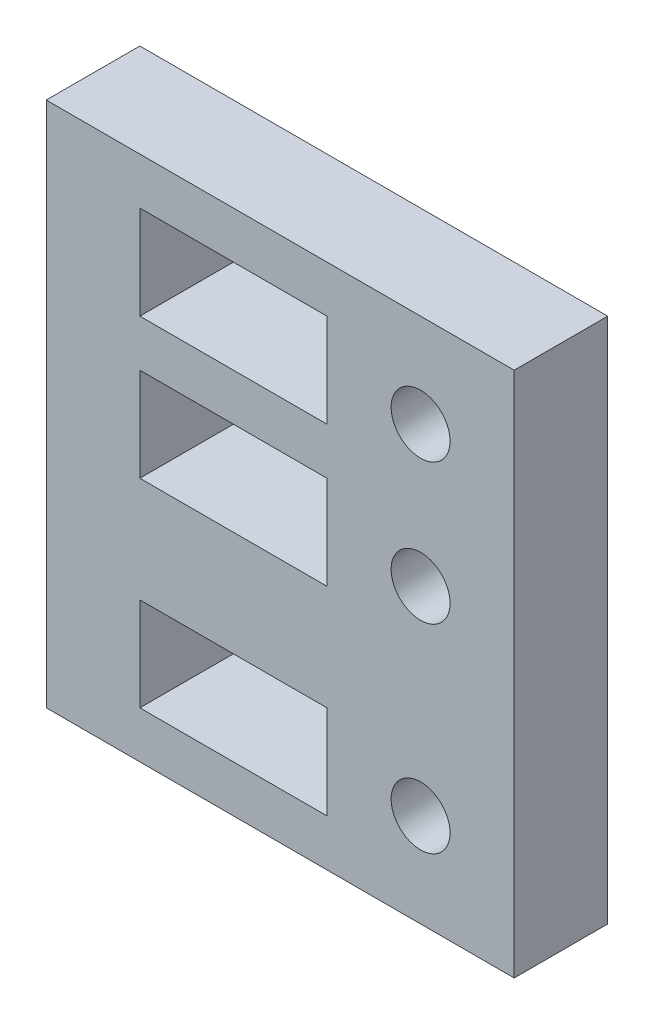
ISO-10303-21;
HEADER;
FILE_DESCRIPTION(('STEP AP214'),'2;1');
FILE_NAME('part.step','',(''),(''),'','','');
FILE_SCHEMA(('AUTOMOTIVE_DESIGN { 1 0 10303 214 1 1 1 1 }'));
ENDSEC;
DATA;
#1=APPLICATION_CONTEXT('core data for automotive mechanical design processes');
#2=APPLICATION_PROTOCOL_DEFINITION('international standard','automotive_design',2000,#1);
#3=PRODUCT_CONTEXT('',#1,'mechanical');
#4=PRODUCT('Part','Part','',(#3));
#5=PRODUCT_RELATED_PRODUCT_CATEGORY('part','',(#4));
#6=PRODUCT_DEFINITION_FORMATION('','',#4);
#7=PRODUCT_DEFINITION_CONTEXT('part definition',#1,'design');
#8=PRODUCT_DEFINITION('design','',#6,#7);
#9=PRODUCT_DEFINITION_SHAPE('','',#8);
#10=(LENGTH_UNIT() NAMED_UNIT(*) SI_UNIT(.MILLI.,.METRE.));
#11=(NAMED_UNIT(*) PLANE_ANGLE_UNIT() SI_UNIT($,.RADIAN.));
#12=(NAMED_UNIT(*) SI_UNIT($,.STERADIAN.) SOLID_ANGLE_UNIT());
#13=UNCERTAINTY_MEASURE_WITH_UNIT(LENGTH_MEASURE(1.E-05),#10,'distance_accuracy_value','');
#14=(GEOMETRIC_REPRESENTATION_CONTEXT(3) GLOBAL_UNCERTAINTY_ASSIGNED_CONTEXT((#13)) GLOBAL_UNIT_ASSIGNED_CONTEXT((#10,
#11,#12)) REPRESENTATION_CONTEXT('',''));
#15=CARTESIAN_POINT('',(0.,0.,0.));
#16=DIRECTION('',(0.,0.,1.));
#17=DIRECTION('',(1.,0.,0.));
#18=AXIS2_PLACEMENT_3D('',#15,#16,#17);
#19=CARTESIAN_POINT('',(0.,0.,6.35));
#20=DIRECTION('',(0.,0.,-1.));
#21=DIRECTION('',(-1.,0.,0.));
#22=AXIS2_PLACEMENT_3D('',#19,#20,#21);
#23=PLANE('',#22);
#24=CARTESIAN_POINT('',(25.4,6.35,6.35));
#25=DIRECTION('',(0.,0.,1.));
#26=DIRECTION('',(1.,0.,0.));
#27=AXIS2_PLACEMENT_3D('',#24,#25,#26);
#28=CIRCLE('',#27,2.);
#29=CARTESIAN_POINT('',(27.4,6.35,6.35));
#30=VERTEX_POINT('',#29);
#31=EDGE_CURVE('E185',#30,#30,#28,.T.);
#32=ORIENTED_EDGE('',*,*,#31,.F.);
#33=EDGE_LOOP('',(#32));
#34=FACE_BOUND('',#33,.T.);
#35=CARTESIAN_POINT('',(25.4,19.84375,6.35));
#36=DIRECTION('',(0.,0.,1.));
#37=DIRECTION('',(1.,0.,0.));
#38=AXIS2_PLACEMENT_3D('',#35,#36,#37);
#39=CIRCLE('',#38,2.);
#40=CARTESIAN_POINT('',(27.4,19.84375,6.35));
#41=VERTEX_POINT('',#40);
#42=EDGE_CURVE('E191',#41,#41,#39,.T.);
#43=ORIENTED_EDGE('',*,*,#42,.F.);
#44=EDGE_LOOP('',(#43));
#45=FACE_BOUND('',#44,.T.);
#46=DIRECTION('',(0.,-1.,0.));
#47=VECTOR('',#46,1.);
#48=CARTESIAN_POINT('',(6.35,9.525,6.35));
#49=LINE('',#48,#47);
#50=CARTESIAN_POINT('',(6.35,9.525,6.35));
#51=VERTEX_POINT('',#50);
#52=CARTESIAN_POINT('',(6.35,3.175,6.35));
#53=VERTEX_POINT('',#52);
#54=EDGE_CURVE('E197',#51,#53,#49,.T.);
#55=ORIENTED_EDGE('',*,*,#54,.F.);
#56=DIRECTION('',(-1.,0.,0.));
#57=VECTOR('',#56,1.);
#58=CARTESIAN_POINT('',(6.35,9.525,6.35));
#59=LINE('',#58,#57);
#60=CARTESIAN_POINT('',(19.05,9.525,6.35));
#61=VERTEX_POINT('',#60);
#62=EDGE_CURVE('E205',#61,#51,#59,.T.);
#63=ORIENTED_EDGE('',*,*,#62,.F.);
#64=DIRECTION('',(0.,1.,0.));
#65=VECTOR('',#64,1.);
#66=CARTESIAN_POINT('',(19.05,9.525,6.35));
#67=LINE('',#66,#65);
#68=CARTESIAN_POINT('',(19.05,3.175,6.35));
#69=VERTEX_POINT('',#68);
#70=EDGE_CURVE('E202',#69,#61,#67,.T.);
#71=ORIENTED_EDGE('',*,*,#70,.F.);
#72=DIRECTION('',(1.,0.,0.));
#73=VECTOR('',#72,1.);
#74=CARTESIAN_POINT('',(6.35,3.175,6.35));
#75=LINE('',#74,#73);
#76=EDGE_CURVE('E199',#53,#69,#75,.T.);
#77=ORIENTED_EDGE('',*,*,#76,.F.);
#78=EDGE_LOOP('',(#55,#63,#71,#77));
#79=FACE_BOUND('',#78,.T.);
#80=DIRECTION('',(0.,-1.,0.));
#81=VECTOR('',#80,1.);
#82=CARTESIAN_POINT('',(0.,0.,6.35));
#83=LINE('',#82,#81);
#84=CARTESIAN_POINT('',(0.,35.71875,6.35));
#85=VERTEX_POINT('',#84);
#86=CARTESIAN_POINT('',(0.,0.,6.35));
#87=VERTEX_POINT('',#86);
#88=EDGE_CURVE('E259',#85,#87,#83,.T.);
#89=ORIENTED_EDGE('',*,*,#88,.T.);
#90=DIRECTION('',(1.,0.,0.));
#91=VECTOR('',#90,1.);
#92=CARTESIAN_POINT('',(0.,0.,6.35));
#93=LINE('',#92,#91);
#94=CARTESIAN_POINT('',(31.75,0.,6.35));
#95=VERTEX_POINT('',#94);
#96=EDGE_CURVE('E262',#87,#95,#93,.T.);
#97=ORIENTED_EDGE('',*,*,#96,.T.);
#98=DIRECTION('',(0.,1.,0.));
#99=VECTOR('',#98,1.);
#100=CARTESIAN_POINT('',(31.75,0.,6.35));
#101=LINE('',#100,#99);
#102=CARTESIAN_POINT('',(31.75,35.71875,6.35));
#103=VERTEX_POINT('',#102);
#104=EDGE_CURVE('E265',#95,#103,#101,.T.);
#105=ORIENTED_EDGE('',*,*,#104,.T.);
#106=DIRECTION('',(-1.,0.,0.));
#107=VECTOR('',#106,1.);
#108=CARTESIAN_POINT('',(0.,35.71875,6.35));
#109=LINE('',#108,#107);
#110=EDGE_CURVE('E267',#103,#85,#109,.T.);
#111=ORIENTED_EDGE('',*,*,#110,.T.);
#112=EDGE_LOOP('',(#89,#97,#105,#111));
#113=FACE_BOUND('',#112,.T.);
#114=DIRECTION('',(0.,-1.,0.));
#115=VECTOR('',#114,1.);
#116=CARTESIAN_POINT('',(6.35,23.01875,6.35));
#117=LINE('',#116,#115);
#118=CARTESIAN_POINT('',(6.35,23.01875,6.35));
#119=VERTEX_POINT('',#118);
#120=CARTESIAN_POINT('',(6.35,16.66875,6.35));
#121=VERTEX_POINT('',#120);
#122=EDGE_CURVE('E228',#119,#121,#117,.T.);
#123=ORIENTED_EDGE('',*,*,#122,.F.);
#124=DIRECTION('',(-1.,0.,0.));
#125=VECTOR('',#124,1.);
#126=CARTESIAN_POINT('',(6.35,23.01875,6.35));
#127=LINE('',#126,#125);
#128=CARTESIAN_POINT('',(19.05,23.01875,6.35));
#129=VERTEX_POINT('',#128);
#130=EDGE_CURVE('E236',#129,#119,#127,.T.);
#131=ORIENTED_EDGE('',*,*,#130,.F.);
#132=DIRECTION('',(0.,1.,0.));
#133=VECTOR('',#132,1.);
#134=CARTESIAN_POINT('',(19.05,23.01875,6.35));
#135=LINE('',#134,#133);
#136=CARTESIAN_POINT('',(19.05,16.66875,6.35));
#137=VERTEX_POINT('',#136);
#138=EDGE_CURVE('E233',#137,#129,#135,.T.);
#139=ORIENTED_EDGE('',*,*,#138,.F.);
#140=DIRECTION('',(1.,0.,0.));
#141=VECTOR('',#140,1.);
#142=CARTESIAN_POINT('',(6.35,16.66875,6.35));
#143=LINE('',#142,#141);
#144=EDGE_CURVE('E230',#121,#137,#143,.T.);
#145=ORIENTED_EDGE('',*,*,#144,.F.);
#146=EDGE_LOOP('',(#123,#131,#139,#145));
#147=FACE_BOUND('',#146,.T.);
#148=DIRECTION('',(0.,1.,0.));
#149=VECTOR('',#148,1.);
#150=CARTESIAN_POINT('',(19.05,26.19375,6.35));
#151=LINE('',#150,#149);
#152=CARTESIAN_POINT('',(19.05,26.19375,6.35));
#153=VERTEX_POINT('',#152);
#154=CARTESIAN_POINT('',(19.05,32.54375,6.35));
#155=VERTEX_POINT('',#154);
#156=EDGE_CURVE('E146',#153,#155,#151,.T.);
#157=ORIENTED_EDGE('',*,*,#156,.F.);
#158=DIRECTION('',(1.,0.,0.));
#159=VECTOR('',#158,1.);
#160=CARTESIAN_POINT('',(19.05,26.19375,6.35));
#161=LINE('',#160,#159);
#162=CARTESIAN_POINT('',(6.35,26.19375,6.35));
#163=VERTEX_POINT('',#162);
#164=EDGE_CURVE('E169',#163,#153,#161,.T.);
#165=ORIENTED_EDGE('',*,*,#164,.F.);
#166=DIRECTION('',(0.,-1.,0.));
#167=VECTOR('',#166,1.);
#168=CARTESIAN_POINT('',(6.35,26.19375,6.35));
#169=LINE('',#168,#167);
#170=CARTESIAN_POINT('',(6.35,32.54375,6.35));
#171=VERTEX_POINT('',#170);
#172=EDGE_CURVE('E167',#171,#163,#169,.T.);
#173=ORIENTED_EDGE('',*,*,#172,.F.);
#174=DIRECTION('',(-1.,0.,0.));
#175=VECTOR('',#174,1.);
#176=CARTESIAN_POINT('',(6.35,32.54375,6.35));
#177=LINE('',#176,#175);
#178=EDGE_CURVE('E154',#155,#171,#177,.T.);
#179=ORIENTED_EDGE('',*,*,#178,.F.);
#180=EDGE_LOOP('',(#157,#165,#173,#179));
#181=FACE_BOUND('',#180,.T.);
#182=CARTESIAN_POINT('',(25.4,29.36875,6.35));
#183=DIRECTION('',(0.,0.,1.));
#184=DIRECTION('',(1.,0.,0.));
#185=AXIS2_PLACEMENT_3D('',#182,#183,#184);
#186=CIRCLE('',#185,2.);
#187=CARTESIAN_POINT('',(27.4,29.36875,6.35));
#188=VERTEX_POINT('',#187);
#189=EDGE_CURVE('E175',#188,#188,#186,.T.);
#190=ORIENTED_EDGE('',*,*,#189,.F.);
#191=EDGE_LOOP('',(#190));
#192=FACE_BOUND('',#191,.T.);
#193=ADVANCED_FACE('F33',(#34,#45,#79,#113,#147,#181,#192),#23,.F.);
#194=CARTESIAN_POINT('',(0.,0.,0.));
#195=DIRECTION('',(0.,0.,-1.));
#196=DIRECTION('',(-1.,0.,0.));
#197=AXIS2_PLACEMENT_3D('',#194,#195,#196);
#198=PLANE('',#197);
#199=DIRECTION('',(1.,0.,0.));
#200=VECTOR('',#199,1.);
#201=CARTESIAN_POINT('',(19.05,26.19375,0.));
#202=LINE('',#201,#200);
#203=CARTESIAN_POINT('',(6.35,26.19375,0.));
#204=VERTEX_POINT('',#203);
#205=CARTESIAN_POINT('',(19.05,26.19375,0.));
#206=VERTEX_POINT('',#205);
#207=EDGE_CURVE('E155',#204,#206,#202,.T.);
#208=ORIENTED_EDGE('',*,*,#207,.T.);
#209=DIRECTION('',(0.,1.,0.));
#210=VECTOR('',#209,1.);
#211=CARTESIAN_POINT('',(19.05,26.19375,0.));
#212=LINE('',#211,#210);
#213=CARTESIAN_POINT('',(19.05,32.54375,0.));
#214=VERTEX_POINT('',#213);
#215=EDGE_CURVE('E56',#206,#214,#212,.T.);
#216=ORIENTED_EDGE('',*,*,#215,.T.);
#217=DIRECTION('',(-1.,0.,0.));
#218=VECTOR('',#217,1.);
#219=CARTESIAN_POINT('',(6.35,32.54375,0.));
#220=LINE('',#219,#218);
#221=CARTESIAN_POINT('',(6.35,32.54375,0.));
#222=VERTEX_POINT('',#221);
#223=EDGE_CURVE('E161',#214,#222,#220,.T.);
#224=ORIENTED_EDGE('',*,*,#223,.T.);
#225=DIRECTION('',(0.,-1.,0.));
#226=VECTOR('',#225,1.);
#227=CARTESIAN_POINT('',(6.35,26.19375,0.));
#228=LINE('',#227,#226);
#229=EDGE_CURVE('E177',#222,#204,#228,.T.);
#230=ORIENTED_EDGE('',*,*,#229,.T.);
#231=EDGE_LOOP('',(#208,#216,#224,#230));
#232=FACE_BOUND('',#231,.T.);
#233=CARTESIAN_POINT('',(25.4,6.35,0.));
#234=DIRECTION('',(0.,0.,1.));
#235=DIRECTION('',(1.,0.,0.));
#236=AXIS2_PLACEMENT_3D('',#233,#234,#235);
#237=CIRCLE('',#236,2.);
#238=CARTESIAN_POINT('',(27.4,6.35,0.));
#239=VERTEX_POINT('',#238);
#240=EDGE_CURVE('E162',#239,#239,#237,.T.);
#241=ORIENTED_EDGE('',*,*,#240,.T.);
#242=EDGE_LOOP('',(#241));
#243=FACE_BOUND('',#242,.T.);
#244=DIRECTION('',(-1.,0.,0.));
#245=VECTOR('',#244,1.);
#246=CARTESIAN_POINT('',(6.35,9.525,0.));
#247=LINE('',#246,#245);
#248=CARTESIAN_POINT('',(19.05,9.525,0.));
#249=VERTEX_POINT('',#248);
#250=CARTESIAN_POINT('',(6.35,9.525,0.));
#251=VERTEX_POINT('',#250);
#252=EDGE_CURVE('E200',#249,#251,#247,.T.);
#253=ORIENTED_EDGE('',*,*,#252,.T.);
#254=DIRECTION('',(0.,-1.,0.));
#255=VECTOR('',#254,1.);
#256=CARTESIAN_POINT('',(6.35,9.525,0.));
#257=LINE('',#256,#255);
#258=CARTESIAN_POINT('',(6.35,3.175,0.));
#259=VERTEX_POINT('',#258);
#260=EDGE_CURVE('E194',#251,#259,#257,.T.);
#261=ORIENTED_EDGE('',*,*,#260,.T.);
#262=DIRECTION('',(1.,0.,0.));
#263=VECTOR('',#262,1.);
#264=CARTESIAN_POINT('',(6.35,3.175,0.));
#265=LINE('',#264,#263);
#266=CARTESIAN_POINT('',(19.05,3.175,0.));
#267=VERTEX_POINT('',#266);
#268=EDGE_CURVE('E210',#259,#267,#265,.T.);
#269=ORIENTED_EDGE('',*,*,#268,.T.);
#270=DIRECTION('',(0.,1.,0.));
#271=VECTOR('',#270,1.);
#272=CARTESIAN_POINT('',(19.05,9.525,0.));
#273=LINE('',#272,#271);
#274=EDGE_CURVE('E213',#267,#249,#273,.T.);
#275=ORIENTED_EDGE('',*,*,#274,.T.);
#276=EDGE_LOOP('',(#253,#261,#269,#275));
#277=FACE_BOUND('',#276,.T.);
#278=DIRECTION('',(-1.,0.,0.));
#279=VECTOR('',#278,1.);
#280=CARTESIAN_POINT('',(6.35,23.01875,0.));
#281=LINE('',#280,#279);
#282=CARTESIAN_POINT('',(19.05,23.01875,0.));
#283=VERTEX_POINT('',#282);
#284=CARTESIAN_POINT('',(6.35,23.01875,0.));
#285=VERTEX_POINT('',#284);
#286=EDGE_CURVE('E231',#283,#285,#281,.T.);
#287=ORIENTED_EDGE('',*,*,#286,.T.);
#288=DIRECTION('',(0.,-1.,0.));
#289=VECTOR('',#288,1.);
#290=CARTESIAN_POINT('',(6.35,23.01875,0.));
#291=LINE('',#290,#289);
#292=CARTESIAN_POINT('',(6.35,16.66875,0.));
#293=VERTEX_POINT('',#292);
#294=EDGE_CURVE('E227',#285,#293,#291,.T.);
#295=ORIENTED_EDGE('',*,*,#294,.T.);
#296=DIRECTION('',(1.,0.,0.));
#297=VECTOR('',#296,1.);
#298=CARTESIAN_POINT('',(6.35,16.66875,0.));
#299=LINE('',#298,#297);
#300=CARTESIAN_POINT('',(19.05,16.66875,0.));
#301=VERTEX_POINT('',#300);
#302=EDGE_CURVE('E241',#293,#301,#299,.T.);
#303=ORIENTED_EDGE('',*,*,#302,.T.);
#304=DIRECTION('',(0.,1.,0.));
#305=VECTOR('',#304,1.);
#306=CARTESIAN_POINT('',(19.05,23.01875,0.));
#307=LINE('',#306,#305);
#308=EDGE_CURVE('E244',#301,#283,#307,.T.);
#309=ORIENTED_EDGE('',*,*,#308,.T.);
#310=EDGE_LOOP('',(#287,#295,#303,#309));
#311=FACE_BOUND('',#310,.T.);
#312=DIRECTION('',(1.,0.,0.));
#313=VECTOR('',#312,1.);
#314=CARTESIAN_POINT('',(0.,0.,0.));
#315=LINE('',#314,#313);
#316=CARTESIAN_POINT('',(0.,0.,0.));
#317=VERTEX_POINT('',#316);
#318=CARTESIAN_POINT('',(31.75,0.,0.));
#319=VERTEX_POINT('',#318);
#320=EDGE_CURVE('E258',#317,#319,#315,.T.);
#321=ORIENTED_EDGE('',*,*,#320,.F.);
#322=DIRECTION('',(0.,-1.,0.));
#323=VECTOR('',#322,1.);
#324=CARTESIAN_POINT('',(0.,35.71875,0.));
#325=LINE('',#324,#323);
#326=CARTESIAN_POINT('',(0.,35.71875,0.));
#327=VERTEX_POINT('',#326);
#328=EDGE_CURVE('E263',#327,#317,#325,.T.);
#329=ORIENTED_EDGE('',*,*,#328,.F.);
#330=DIRECTION('',(-1.,0.,0.));
#331=VECTOR('',#330,1.);
#332=CARTESIAN_POINT('',(0.,35.71875,0.));
#333=LINE('',#332,#331);
#334=CARTESIAN_POINT('',(31.75,35.71875,0.));
#335=VERTEX_POINT('',#334);
#336=EDGE_CURVE('E275',#335,#327,#333,.T.);
#337=ORIENTED_EDGE('',*,*,#336,.F.);
#338=DIRECTION('',(0.,1.,0.));
#339=VECTOR('',#338,1.);
#340=CARTESIAN_POINT('',(31.75,35.71875,0.));
#341=LINE('',#340,#339);
#342=EDGE_CURVE('E273',#319,#335,#341,.T.);
#343=ORIENTED_EDGE('',*,*,#342,.F.);
#344=EDGE_LOOP('',(#321,#329,#337,#343));
#345=FACE_BOUND('',#344,.T.);
#346=CARTESIAN_POINT('',(25.4,19.84375,0.));
#347=DIRECTION('',(0.,0.,1.));
#348=DIRECTION('',(1.,0.,0.));
#349=AXIS2_PLACEMENT_3D('',#346,#347,#348);
#350=CIRCLE('',#349,2.);
#351=CARTESIAN_POINT('',(27.4,19.84375,0.));
#352=VERTEX_POINT('',#351);
#353=EDGE_CURVE('E188',#352,#352,#350,.T.);
#354=ORIENTED_EDGE('',*,*,#353,.T.);
#355=EDGE_LOOP('',(#354));
#356=FACE_BOUND('',#355,.T.);
#357=CARTESIAN_POINT('',(25.4,29.36875,0.));
#358=DIRECTION('',(0.,0.,1.));
#359=DIRECTION('',(1.,0.,0.));
#360=AXIS2_PLACEMENT_3D('',#357,#358,#359);
#361=CIRCLE('',#360,2.);
#362=CARTESIAN_POINT('',(27.4,29.36875,0.));
#363=VERTEX_POINT('',#362);
#364=EDGE_CURVE('E514',#363,#363,#361,.T.);
#365=ORIENTED_EDGE('',*,*,#364,.T.);
#366=EDGE_LOOP('',(#365));
#367=FACE_BOUND('',#366,.T.);
#368=ADVANCED_FACE('F293',(#232,#243,#277,#311,#345,#356,#367),#198,.T.);
#369=CARTESIAN_POINT('',(0.,0.,6.35));
#370=DIRECTION('',(0.,1.,0.));
#371=DIRECTION('',(0.,0.,1.));
#372=AXIS2_PLACEMENT_3D('',#369,#370,#371);
#373=PLANE('',#372);
#374=ORIENTED_EDGE('',*,*,#320,.T.);
#375=DIRECTION('',(0.,0.,-1.));
#376=VECTOR('',#375,1.);
#377=CARTESIAN_POINT('',(31.75,0.,6.35));
#378=LINE('',#377,#376);
#379=EDGE_CURVE('E41',#95,#319,#378,.T.);
#380=ORIENTED_EDGE('',*,*,#379,.F.);
#381=ORIENTED_EDGE('',*,*,#96,.F.);
#382=DIRECTION('',(0.,0.,-1.));
#383=VECTOR('',#382,1.);
#384=CARTESIAN_POINT('',(0.,0.,6.35));
#385=LINE('',#384,#383);
#386=EDGE_CURVE('E11',#87,#317,#385,.T.);
#387=ORIENTED_EDGE('',*,*,#386,.T.);
#388=EDGE_LOOP('',(#374,#380,#381,#387));
#389=FACE_BOUND('',#388,.T.);
#390=ADVANCED_FACE('F35',(#389),#373,.F.);
#391=CARTESIAN_POINT('',(31.75,35.71875,6.35));
#392=DIRECTION('',(-1.,0.,0.));
#393=DIRECTION('',(0.,0.,1.));
#394=AXIS2_PLACEMENT_3D('',#391,#392,#393);
#395=PLANE('',#394);
#396=ORIENTED_EDGE('',*,*,#342,.T.);
#397=DIRECTION('',(0.,0.,-1.));
#398=VECTOR('',#397,1.);
#399=CARTESIAN_POINT('',(31.75,35.71875,6.35));
#400=LINE('',#399,#398);
#401=EDGE_CURVE('E280',#103,#335,#400,.T.);
#402=ORIENTED_EDGE('',*,*,#401,.F.);
#403=ORIENTED_EDGE('',*,*,#104,.F.);
#404=ORIENTED_EDGE('',*,*,#379,.T.);
#405=EDGE_LOOP('',(#396,#402,#403,#404));
#406=FACE_BOUND('',#405,.T.);
#407=ADVANCED_FACE('F286',(#406),#395,.F.);
#408=CARTESIAN_POINT('',(0.,35.71875,6.35));
#409=DIRECTION('',(0.,-1.,0.));
#410=DIRECTION('',(0.,0.,-1.));
#411=AXIS2_PLACEMENT_3D('',#408,#409,#410);
#412=PLANE('',#411);
#413=ORIENTED_EDGE('',*,*,#336,.T.);
#414=DIRECTION('',(0.,0.,-1.));
#415=VECTOR('',#414,1.);
#416=CARTESIAN_POINT('',(0.,35.71875,6.35));
#417=LINE('',#416,#415);
#418=EDGE_CURVE('E270',#85,#327,#417,.T.);
#419=ORIENTED_EDGE('',*,*,#418,.F.);
#420=ORIENTED_EDGE('',*,*,#110,.F.);
#421=ORIENTED_EDGE('',*,*,#401,.T.);
#422=EDGE_LOOP('',(#413,#419,#420,#421));
#423=FACE_BOUND('',#422,.T.);
#424=ADVANCED_FACE('F298',(#423),#412,.F.);
#425=CARTESIAN_POINT('',(0.,35.71875,6.35));
#426=DIRECTION('',(1.,0.,0.));
#427=DIRECTION('',(0.,0.,-1.));
#428=AXIS2_PLACEMENT_3D('',#425,#426,#427);
#429=PLANE('',#428);
#430=ORIENTED_EDGE('',*,*,#328,.T.);
#431=ORIENTED_EDGE('',*,*,#386,.F.);
#432=ORIENTED_EDGE('',*,*,#88,.F.);
#433=ORIENTED_EDGE('',*,*,#418,.T.);
#434=EDGE_LOOP('',(#430,#431,#432,#433));
#435=FACE_BOUND('',#434,.T.);
#436=ADVANCED_FACE('F301',(#435),#429,.F.);
#437=CARTESIAN_POINT('',(6.35,23.01875,6.35));
#438=DIRECTION('',(1.,0.,0.));
#439=DIRECTION('',(0.,0.,-1.));
#440=AXIS2_PLACEMENT_3D('',#437,#438,#439);
#441=PLANE('',#440);
#442=ORIENTED_EDGE('',*,*,#294,.F.);
#443=DIRECTION('',(0.,0.,-1.));
#444=VECTOR('',#443,1.);
#445=CARTESIAN_POINT('',(6.35,23.01875,6.35));
#446=LINE('',#445,#444);
#447=EDGE_CURVE('E238',#119,#285,#446,.T.);
#448=ORIENTED_EDGE('',*,*,#447,.F.);
#449=ORIENTED_EDGE('',*,*,#122,.T.);
#450=DIRECTION('',(0.,0.,-1.));
#451=VECTOR('',#450,1.);
#452=CARTESIAN_POINT('',(6.35,16.66875,6.35));
#453=LINE('',#452,#451);
#454=EDGE_CURVE('E255',#121,#293,#453,.T.);
#455=ORIENTED_EDGE('',*,*,#454,.T.);
#456=EDGE_LOOP('',(#442,#448,#449,#455));
#457=FACE_BOUND('',#456,.T.);
#458=ADVANCED_FACE('F314',(#457),#441,.T.);
#459=CARTESIAN_POINT('',(6.35,16.66875,6.35));
#460=DIRECTION('',(0.,1.,0.));
#461=DIRECTION('',(0.,0.,1.));
#462=AXIS2_PLACEMENT_3D('',#459,#460,#461);
#463=PLANE('',#462);
#464=ORIENTED_EDGE('',*,*,#302,.F.);
#465=ORIENTED_EDGE('',*,*,#454,.F.);
#466=ORIENTED_EDGE('',*,*,#144,.T.);
#467=DIRECTION('',(0.,0.,-1.));
#468=VECTOR('',#467,1.);
#469=CARTESIAN_POINT('',(19.05,16.66875,6.35));
#470=LINE('',#469,#468);
#471=EDGE_CURVE('E253',#137,#301,#470,.T.);
#472=ORIENTED_EDGE('',*,*,#471,.T.);
#473=EDGE_LOOP('',(#464,#465,#466,#472));
#474=FACE_BOUND('',#473,.T.);
#475=ADVANCED_FACE('F316',(#474),#463,.T.);
#476=CARTESIAN_POINT('',(19.05,23.01875,6.35));
#477=DIRECTION('',(-1.,0.,0.));
#478=DIRECTION('',(0.,0.,1.));
#479=AXIS2_PLACEMENT_3D('',#476,#477,#478);
#480=PLANE('',#479);
#481=ORIENTED_EDGE('',*,*,#308,.F.);
#482=ORIENTED_EDGE('',*,*,#471,.F.);
#483=ORIENTED_EDGE('',*,*,#138,.T.);
#484=DIRECTION('',(0.,0.,-1.));
#485=VECTOR('',#484,1.);
#486=CARTESIAN_POINT('',(19.05,23.01875,6.35));
#487=LINE('',#486,#485);
#488=EDGE_CURVE('E251',#129,#283,#487,.T.);
#489=ORIENTED_EDGE('',*,*,#488,.T.);
#490=EDGE_LOOP('',(#481,#482,#483,#489));
#491=FACE_BOUND('',#490,.T.);
#492=ADVANCED_FACE('F324',(#491),#480,.T.);
#493=CARTESIAN_POINT('',(6.35,23.01875,6.35));
#494=DIRECTION('',(0.,-1.,0.));
#495=DIRECTION('',(0.,0.,-1.));
#496=AXIS2_PLACEMENT_3D('',#493,#494,#495);
#497=PLANE('',#496);
#498=ORIENTED_EDGE('',*,*,#286,.F.);
#499=ORIENTED_EDGE('',*,*,#488,.F.);
#500=ORIENTED_EDGE('',*,*,#130,.T.);
#501=ORIENTED_EDGE('',*,*,#447,.T.);
#502=EDGE_LOOP('',(#498,#499,#500,#501));
#503=FACE_BOUND('',#502,.T.);
#504=ADVANCED_FACE('F322',(#503),#497,.T.);
#505=CARTESIAN_POINT('',(6.35,9.525,6.35));
#506=DIRECTION('',(1.,0.,0.));
#507=DIRECTION('',(0.,1.,0.));
#508=AXIS2_PLACEMENT_3D('',#505,#506,#507);
#509=PLANE('',#508);
#510=ORIENTED_EDGE('',*,*,#260,.F.);
#511=DIRECTION('',(0.,0.,-1.));
#512=VECTOR('',#511,1.);
#513=CARTESIAN_POINT('',(6.35,9.525,6.35));
#514=LINE('',#513,#512);
#515=EDGE_CURVE('E207',#51,#251,#514,.T.);
#516=ORIENTED_EDGE('',*,*,#515,.F.);
#517=ORIENTED_EDGE('',*,*,#54,.T.);
#518=DIRECTION('',(0.,0.,-1.));
#519=VECTOR('',#518,1.);
#520=CARTESIAN_POINT('',(6.35,3.175,6.35));
#521=LINE('',#520,#519);
#522=EDGE_CURVE('E224',#53,#259,#521,.T.);
#523=ORIENTED_EDGE('',*,*,#522,.T.);
#524=EDGE_LOOP('',(#510,#516,#517,#523));
#525=FACE_BOUND('',#524,.T.);
#526=ADVANCED_FACE('F331',(#525),#509,.T.);
#527=CARTESIAN_POINT('',(6.35,3.175,6.35));
#528=DIRECTION('',(0.,1.,0.));
#529=DIRECTION('',(0.,0.,1.));
#530=AXIS2_PLACEMENT_3D('',#527,#528,#529);
#531=PLANE('',#530);
#532=ORIENTED_EDGE('',*,*,#268,.F.);
#533=ORIENTED_EDGE('',*,*,#522,.F.);
#534=ORIENTED_EDGE('',*,*,#76,.T.);
#535=DIRECTION('',(0.,0.,-1.));
#536=VECTOR('',#535,1.);
#537=CARTESIAN_POINT('',(19.05,3.175,6.35));
#538=LINE('',#537,#536);
#539=EDGE_CURVE('E222',#69,#267,#538,.T.);
#540=ORIENTED_EDGE('',*,*,#539,.T.);
#541=EDGE_LOOP('',(#532,#533,#534,#540));
#542=FACE_BOUND('',#541,.T.);
#543=ADVANCED_FACE('F411',(#542),#531,.T.);
#544=CARTESIAN_POINT('',(19.05,9.525,6.35));
#545=DIRECTION('',(-1.,0.,0.));
#546=DIRECTION('',(0.,0.,1.));
#547=AXIS2_PLACEMENT_3D('',#544,#545,#546);
#548=PLANE('',#547);
#549=ORIENTED_EDGE('',*,*,#274,.F.);
#550=ORIENTED_EDGE('',*,*,#539,.F.);
#551=ORIENTED_EDGE('',*,*,#70,.T.);
#552=DIRECTION('',(0.,0.,-1.));
#553=VECTOR('',#552,1.);
#554=CARTESIAN_POINT('',(19.05,9.525,6.35));
#555=LINE('',#554,#553);
#556=EDGE_CURVE('E220',#61,#249,#555,.T.);
#557=ORIENTED_EDGE('',*,*,#556,.T.);
#558=EDGE_LOOP('',(#549,#550,#551,#557));
#559=FACE_BOUND('',#558,.T.);
#560=ADVANCED_FACE('F419',(#559),#548,.T.);
#561=CARTESIAN_POINT('',(6.35,9.525,6.35));
#562=DIRECTION('',(0.,-1.,0.));
#563=DIRECTION('',(0.,0.,-1.));
#564=AXIS2_PLACEMENT_3D('',#561,#562,#563);
#565=PLANE('',#564);
#566=ORIENTED_EDGE('',*,*,#252,.F.);
#567=ORIENTED_EDGE('',*,*,#556,.F.);
#568=ORIENTED_EDGE('',*,*,#62,.T.);
#569=ORIENTED_EDGE('',*,*,#515,.T.);
#570=EDGE_LOOP('',(#566,#567,#568,#569));
#571=FACE_BOUND('',#570,.T.);
#572=ADVANCED_FACE('F428',(#571),#565,.T.);
#573=CARTESIAN_POINT('',(25.4,19.84375,6.35));
#574=DIRECTION('',(0.,0.,-1.));
#575=DIRECTION('',(-1.,0.,0.));
#576=AXIS2_PLACEMENT_3D('',#573,#574,#575);
#577=CYLINDRICAL_SURFACE('',#576,2.);
#578=ORIENTED_EDGE('',*,*,#42,.T.);
#579=EDGE_LOOP('',(#578));
#580=FACE_BOUND('',#579,.T.);
#581=ORIENTED_EDGE('',*,*,#353,.F.);
#582=EDGE_LOOP('',(#581));
#583=FACE_BOUND('',#582,.T.);
#584=ADVANCED_FACE('F437',(#580,#583),#577,.F.);
#585=CARTESIAN_POINT('',(25.4,6.35,6.35));
#586=DIRECTION('',(0.,0.,-1.));
#587=DIRECTION('',(-1.,0.,0.));
#588=AXIS2_PLACEMENT_3D('',#585,#586,#587);
#589=CYLINDRICAL_SURFACE('',#588,2.);
#590=ORIENTED_EDGE('',*,*,#31,.T.);
#591=EDGE_LOOP('',(#590));
#592=FACE_BOUND('',#591,.T.);
#593=ORIENTED_EDGE('',*,*,#240,.F.);
#594=EDGE_LOOP('',(#593));
#595=FACE_BOUND('',#594,.T.);
#596=ADVANCED_FACE('F446',(#592,#595),#589,.F.);
#597=CARTESIAN_POINT('',(19.05,26.19375,6.35));
#598=DIRECTION('',(-1.,0.,0.));
#599=DIRECTION('',(0.,-1.,0.));
#600=AXIS2_PLACEMENT_3D('',#597,#598,#599);
#601=PLANE('',#600);
#602=ORIENTED_EDGE('',*,*,#215,.F.);
#603=DIRECTION('',(0.,0.,-1.));
#604=VECTOR('',#603,1.);
#605=CARTESIAN_POINT('',(19.05,26.19375,6.35));
#606=LINE('',#605,#604);
#607=EDGE_CURVE('E150',#153,#206,#606,.T.);
#608=ORIENTED_EDGE('',*,*,#607,.F.);
#609=ORIENTED_EDGE('',*,*,#156,.T.);
#610=DIRECTION('',(0.,0.,-1.));
#611=VECTOR('',#610,1.);
#612=CARTESIAN_POINT('',(19.05,32.54375,6.35));
#613=LINE('',#612,#611);
#614=EDGE_CURVE('E149',#155,#214,#613,.T.);
#615=ORIENTED_EDGE('',*,*,#614,.T.);
#616=EDGE_LOOP('',(#602,#608,#609,#615));
#617=FACE_BOUND('',#616,.T.);
#618=ADVANCED_FACE('F148',(#617),#601,.T.);
#619=CARTESIAN_POINT('',(6.35,32.54375,6.35));
#620=DIRECTION('',(0.,-1.,0.));
#621=DIRECTION('',(1.,0.,0.));
#622=AXIS2_PLACEMENT_3D('',#619,#620,#621);
#623=PLANE('',#622);
#624=ORIENTED_EDGE('',*,*,#223,.F.);
#625=ORIENTED_EDGE('',*,*,#614,.F.);
#626=ORIENTED_EDGE('',*,*,#178,.T.);
#627=DIRECTION('',(0.,0.,-1.));
#628=VECTOR('',#627,1.);
#629=CARTESIAN_POINT('',(6.35,32.54375,6.35));
#630=LINE('',#629,#628);
#631=EDGE_CURVE('E163',#171,#222,#630,.T.);
#632=ORIENTED_EDGE('',*,*,#631,.T.);
#633=EDGE_LOOP('',(#624,#625,#626,#632));
#634=FACE_BOUND('',#633,.T.);
#635=ADVANCED_FACE('F158',(#634),#623,.T.);
#636=CARTESIAN_POINT('',(6.35,26.19375,6.35));
#637=DIRECTION('',(1.,0.,0.));
#638=DIRECTION('',(0.,0.,-1.));
#639=AXIS2_PLACEMENT_3D('',#636,#637,#638);
#640=PLANE('',#639);
#641=ORIENTED_EDGE('',*,*,#229,.F.);
#642=ORIENTED_EDGE('',*,*,#631,.F.);
#643=ORIENTED_EDGE('',*,*,#172,.T.);
#644=DIRECTION('',(0.,0.,-1.));
#645=VECTOR('',#644,1.);
#646=CARTESIAN_POINT('',(6.35,26.19375,6.35));
#647=LINE('',#646,#645);
#648=EDGE_CURVE('E48',#163,#204,#647,.T.);
#649=ORIENTED_EDGE('',*,*,#648,.T.);
#650=EDGE_LOOP('',(#641,#642,#643,#649));
#651=FACE_BOUND('',#650,.T.);
#652=ADVANCED_FACE('F470',(#651),#640,.T.);
#653=CARTESIAN_POINT('',(19.05,26.19375,6.35));
#654=DIRECTION('',(0.,1.,0.));
#655=DIRECTION('',(0.,0.,1.));
#656=AXIS2_PLACEMENT_3D('',#653,#654,#655);
#657=PLANE('',#656);
#658=ORIENTED_EDGE('',*,*,#207,.F.);
#659=ORIENTED_EDGE('',*,*,#648,.F.);
#660=ORIENTED_EDGE('',*,*,#164,.T.);
#661=ORIENTED_EDGE('',*,*,#607,.T.);
#662=EDGE_LOOP('',(#658,#659,#660,#661));
#663=FACE_BOUND('',#662,.T.);
#664=ADVANCED_FACE('F478',(#663),#657,.T.);
#665=CARTESIAN_POINT('',(25.4,29.36875,6.35));
#666=DIRECTION('',(0.,0.,-1.));
#667=DIRECTION('',(-1.,0.,0.));
#668=AXIS2_PLACEMENT_3D('',#665,#666,#667);
#669=CYLINDRICAL_SURFACE('',#668,2.);
#670=ORIENTED_EDGE('',*,*,#189,.T.);
#671=EDGE_LOOP('',(#670));
#672=FACE_BOUND('',#671,.T.);
#673=ORIENTED_EDGE('',*,*,#364,.F.);
#674=EDGE_LOOP('',(#673));
#675=FACE_BOUND('',#674,.T.);
#676=ADVANCED_FACE('F487',(#672,#675),#669,.F.);
#677=CLOSED_SHELL('',(#193,#368,#390,#407,#424,#436,#458,#475,#492,#504,#526,#543,#560,#572,
#584,#596,#618,#635,#652,#664,#676));
#678=MANIFOLD_SOLID_BREP('B2',#677);
#679=ADVANCED_BREP_SHAPE_REPRESENTATION('',(#18,#678),#14);
#680=SHAPE_DEFINITION_REPRESENTATION(#9,#679);
ENDSEC;
END-ISO-10303-21;
